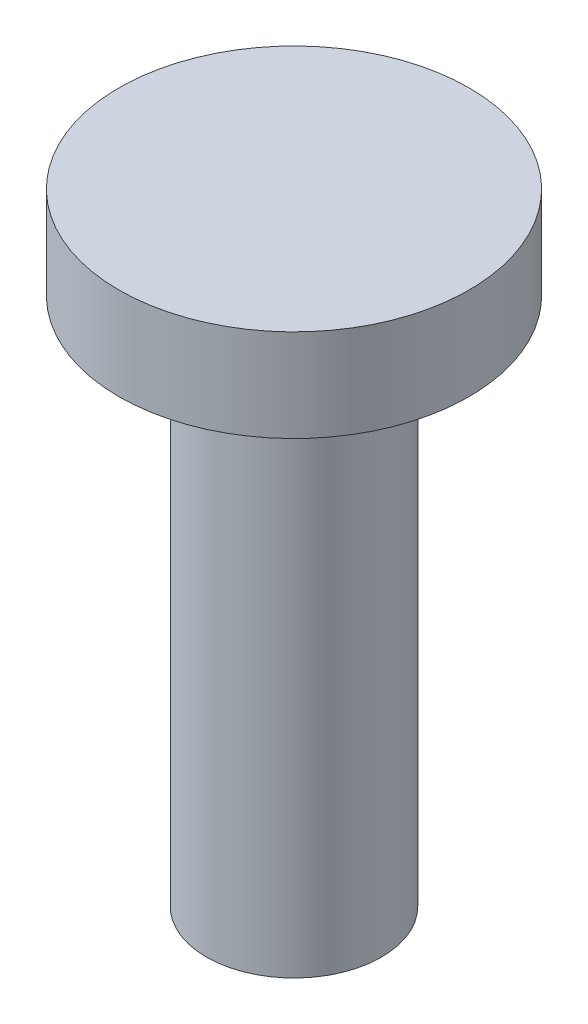
ISO-10303-21;
HEADER;
FILE_DESCRIPTION(('STEP AP214'),'2;1');
FILE_NAME('part.step','',(''),(''),'','','');
FILE_SCHEMA(('AUTOMOTIVE_DESIGN { 1 0 10303 214 1 1 1 1 }'));
ENDSEC;
DATA;
#1=APPLICATION_CONTEXT('core data for automotive mechanical design processes');
#2=APPLICATION_PROTOCOL_DEFINITION('international standard','automotive_design',2000,#1);
#3=PRODUCT_CONTEXT('',#1,'mechanical');
#4=PRODUCT('Part','Part','',(#3));
#5=PRODUCT_RELATED_PRODUCT_CATEGORY('part','',(#4));
#6=PRODUCT_DEFINITION_FORMATION('','',#4);
#7=PRODUCT_DEFINITION_CONTEXT('part definition',#1,'design');
#8=PRODUCT_DEFINITION('design','',#6,#7);
#9=PRODUCT_DEFINITION_SHAPE('','',#8);
#10=(LENGTH_UNIT() NAMED_UNIT(*) SI_UNIT(.MILLI.,.METRE.));
#11=(NAMED_UNIT(*) PLANE_ANGLE_UNIT() SI_UNIT($,.RADIAN.));
#12=(NAMED_UNIT(*) SI_UNIT($,.STERADIAN.) SOLID_ANGLE_UNIT());
#13=UNCERTAINTY_MEASURE_WITH_UNIT(LENGTH_MEASURE(1.E-05),#10,'distance_accuracy_value','');
#14=(GEOMETRIC_REPRESENTATION_CONTEXT(3) GLOBAL_UNCERTAINTY_ASSIGNED_CONTEXT((#13)) GLOBAL_UNIT_ASSIGNED_CONTEXT((#10,
#11,#12)) REPRESENTATION_CONTEXT('',''));
#15=CARTESIAN_POINT('',(0.,0.,0.));
#16=DIRECTION('',(0.,0.,1.));
#17=DIRECTION('',(1.,0.,0.));
#18=AXIS2_PLACEMENT_3D('',#15,#16,#17);
#19=CARTESIAN_POINT('',(0.,20.,0.));
#20=DIRECTION('',(0.,-1.,0.));
#21=DIRECTION('',(0.,0.,-1.));
#22=AXIS2_PLACEMENT_3D('',#19,#20,#21);
#23=CYLINDRICAL_SURFACE('',#22,3.175);
#24=CARTESIAN_POINT('',(0.,0.,0.));
#25=DIRECTION('',(0.,1.,0.));
#26=DIRECTION('',(0.,0.,1.));
#27=AXIS2_PLACEMENT_3D('',#24,#25,#26);
#28=CIRCLE('',#27,3.175);
#29=CARTESIAN_POINT('',(0.,0.,3.175));
#30=VERTEX_POINT('',#29);
#31=EDGE_CURVE('E39',#30,#30,#28,.T.);
#32=ORIENTED_EDGE('',*,*,#31,.T.);
#33=EDGE_LOOP('',(#32));
#34=FACE_BOUND('',#33,.T.);
#35=CARTESIAN_POINT('',(0.,19.19,0.));
#36=DIRECTION('',(0.,1.,0.));
#37=DIRECTION('',(0.,0.,1.));
#38=AXIS2_PLACEMENT_3D('',#35,#36,#37);
#39=CIRCLE('',#38,3.175);
#40=CARTESIAN_POINT('',(0.,19.19,3.175));
#41=VERTEX_POINT('',#40);
#42=EDGE_CURVE('E10',#41,#41,#39,.T.);
#43=ORIENTED_EDGE('',*,*,#42,.F.);
#44=EDGE_LOOP('',(#43));
#45=FACE_BOUND('',#44,.T.);
#46=ADVANCED_FACE('F33',(#34,#45),#23,.T.);
#47=CARTESIAN_POINT('',(0.,0.,0.));
#48=DIRECTION('',(0.,1.,0.));
#49=DIRECTION('',(0.,0.,1.));
#50=AXIS2_PLACEMENT_3D('',#47,#48,#49);
#51=PLANE('',#50);
#52=CARTESIAN_POINT('',(0.,0.,0.));
#53=DIRECTION('',(0.,-1.,0.));
#54=DIRECTION('',(0.,0.,-1.));
#55=AXIS2_PLACEMENT_3D('',#52,#53,#54);
#56=CIRCLE('',#55,1.675);
#57=CARTESIAN_POINT('',(0.,0.,-1.675));
#58=VERTEX_POINT('',#57);
#59=EDGE_CURVE('E47',#58,#58,#56,.T.);
#60=ORIENTED_EDGE('',*,*,#59,.F.);
#61=EDGE_LOOP('',(#60));
#62=FACE_BOUND('',#61,.T.);
#63=ORIENTED_EDGE('',*,*,#31,.F.);
#64=EDGE_LOOP('',(#63));
#65=FACE_BOUND('',#64,.T.);
#66=ADVANCED_FACE('F76',(#62,#65),#51,.F.);
#67=CARTESIAN_POINT('',(0.,12.,0.));
#68=DIRECTION('',(0.,-1.,0.));
#69=DIRECTION('',(0.,0.,-1.));
#70=AXIS2_PLACEMENT_3D('',#67,#68,#69);
#71=CYLINDRICAL_SURFACE('',#70,1.675);
#72=CARTESIAN_POINT('',(0.,12.,0.));
#73=DIRECTION('',(0.,-1.,0.));
#74=DIRECTION('',(0.,0.,-1.));
#75=AXIS2_PLACEMENT_3D('',#72,#73,#74);
#76=CIRCLE('',#75,1.675);
#77=CARTESIAN_POINT('',(0.,12.,-1.675));
#78=VERTEX_POINT('',#77);
#79=EDGE_CURVE('E43',#78,#78,#76,.T.);
#80=ORIENTED_EDGE('',*,*,#79,.F.);
#81=EDGE_LOOP('',(#80));
#82=FACE_BOUND('',#81,.T.);
#83=ORIENTED_EDGE('',*,*,#59,.T.);
#84=EDGE_LOOP('',(#83));
#85=FACE_BOUND('',#84,.T.);
#86=ADVANCED_FACE('F72',(#82,#85),#71,.F.);
#87=CARTESIAN_POINT('',(0.,12.,0.));
#88=DIRECTION('',(0.,-1.,0.));
#89=DIRECTION('',(0.,0.,-1.));
#90=AXIS2_PLACEMENT_3D('',#87,#88,#89);
#91=PLANE('',#90);
#92=ORIENTED_EDGE('',*,*,#79,.T.);
#93=EDGE_LOOP('',(#92));
#94=FACE_BOUND('',#93,.T.);
#95=ADVANCED_FACE('F64',(#94),#91,.T.);
#96=CARTESIAN_POINT('',(0.,19.19,0.));
#97=DIRECTION('',(0.,1.,0.));
#98=DIRECTION('',(0.,0.,1.));
#99=AXIS2_PLACEMENT_3D('',#96,#97,#98);
#100=PLANE('',#99);
#101=CARTESIAN_POINT('',(0.,19.19,0.));
#102=DIRECTION('',(0.,1.,0.));
#103=DIRECTION('',(0.,0.,1.));
#104=AXIS2_PLACEMENT_3D('',#101,#102,#103);
#105=CIRCLE('',#104,6.35);
#106=CARTESIAN_POINT('',(0.,19.19,6.35));
#107=VERTEX_POINT('',#106);
#108=EDGE_CURVE('E55',#107,#107,#105,.T.);
#109=ORIENTED_EDGE('',*,*,#108,.F.);
#110=EDGE_LOOP('',(#109));
#111=FACE_BOUND('',#110,.T.);
#112=ORIENTED_EDGE('',*,*,#42,.T.);
#113=EDGE_LOOP('',(#112));
#114=FACE_BOUND('',#113,.T.);
#115=ADVANCED_FACE('F61',(#111,#114),#100,.F.);
#116=CARTESIAN_POINT('',(0.,22.54,0.));
#117=DIRECTION('',(0.,1.,0.));
#118=DIRECTION('',(0.,0.,1.));
#119=AXIS2_PLACEMENT_3D('',#116,#117,#118);
#120=PLANE('',#119);
#121=CARTESIAN_POINT('',(0.,22.54,0.));
#122=DIRECTION('',(0.,1.,0.));
#123=DIRECTION('',(0.,0.,1.));
#124=AXIS2_PLACEMENT_3D('',#121,#122,#123);
#125=CIRCLE('',#124,6.35);
#126=CARTESIAN_POINT('',(0.,22.54,6.35));
#127=VERTEX_POINT('',#126);
#128=EDGE_CURVE('E51',#127,#127,#125,.T.);
#129=ORIENTED_EDGE('',*,*,#128,.T.);
#130=EDGE_LOOP('',(#129));
#131=FACE_BOUND('',#130,.T.);
#132=ADVANCED_FACE('F63',(#131),#120,.T.);
#133=CARTESIAN_POINT('',(0.,22.54,0.));
#134=DIRECTION('',(0.,-1.,0.));
#135=DIRECTION('',(0.,0.,-1.));
#136=AXIS2_PLACEMENT_3D('',#133,#134,#135);
#137=CYLINDRICAL_SURFACE('',#136,6.35);
#138=ORIENTED_EDGE('',*,*,#128,.F.);
#139=EDGE_LOOP('',(#138));
#140=FACE_BOUND('',#139,.T.);
#141=ORIENTED_EDGE('',*,*,#108,.T.);
#142=EDGE_LOOP('',(#141));
#143=FACE_BOUND('',#142,.T.);
#144=ADVANCED_FACE('F59',(#140,#143),#137,.T.);
#145=CLOSED_SHELL('',(#46,#66,#86,#95,#115,#132,#144));
#146=MANIFOLD_SOLID_BREP('B2',#145);
#147=ADVANCED_BREP_SHAPE_REPRESENTATION('',(#18,#146),#14);
#148=SHAPE_DEFINITION_REPRESENTATION(#9,#147);
ENDSEC;
END-ISO-10303-21;
